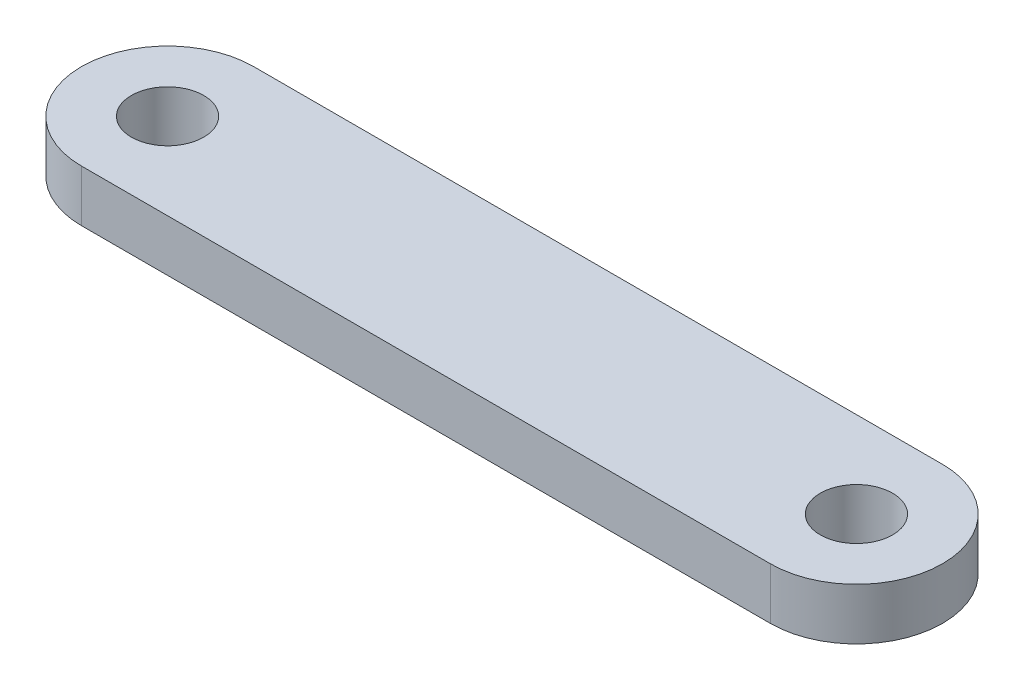
ISO-10303-21;
HEADER;
FILE_DESCRIPTION(('STEP AP214'),'2;1');
FILE_NAME('part.step','',(''),(''),'','','');
FILE_SCHEMA(('AUTOMOTIVE_DESIGN { 1 0 10303 214 1 1 1 1 }'));
ENDSEC;
DATA;
#1=APPLICATION_CONTEXT('core data for automotive mechanical design processes');
#2=APPLICATION_PROTOCOL_DEFINITION('international standard','automotive_design',2000,#1);
#3=PRODUCT_CONTEXT('',#1,'mechanical');
#4=PRODUCT('Part','Part','',(#3));
#5=PRODUCT_RELATED_PRODUCT_CATEGORY('part','',(#4));
#6=PRODUCT_DEFINITION_FORMATION('','',#4);
#7=PRODUCT_DEFINITION_CONTEXT('part definition',#1,'design');
#8=PRODUCT_DEFINITION('design','',#6,#7);
#9=PRODUCT_DEFINITION_SHAPE('','',#8);
#10=(LENGTH_UNIT() NAMED_UNIT(*) SI_UNIT(.MILLI.,.METRE.));
#11=(NAMED_UNIT(*) PLANE_ANGLE_UNIT() SI_UNIT($,.RADIAN.));
#12=(NAMED_UNIT(*) SI_UNIT($,.STERADIAN.) SOLID_ANGLE_UNIT());
#13=UNCERTAINTY_MEASURE_WITH_UNIT(LENGTH_MEASURE(1.E-05),#10,'distance_accuracy_value','');
#14=(GEOMETRIC_REPRESENTATION_CONTEXT(3) GLOBAL_UNCERTAINTY_ASSIGNED_CONTEXT((#13)) GLOBAL_UNIT_ASSIGNED_CONTEXT((#10,
#11,#12)) REPRESENTATION_CONTEXT('',''));
#15=CARTESIAN_POINT('',(0.,0.,0.));
#16=DIRECTION('',(0.,0.,1.));
#17=DIRECTION('',(1.,0.,0.));
#18=AXIS2_PLACEMENT_3D('',#15,#16,#17);
#19=CARTESIAN_POINT('',(-20.,3.,0.));
#20=DIRECTION('',(0.,1.,0.));
#21=DIRECTION('',(0.,0.,1.));
#22=AXIS2_PLACEMENT_3D('',#19,#20,#21);
#23=PLANE('',#22);
#24=CARTESIAN_POINT('',(-20.,3.,0.));
#25=DIRECTION('',(0.,1.,0.));
#26=DIRECTION('',(0.,0.,1.));
#27=AXIS2_PLACEMENT_3D('',#24,#25,#26);
#28=CIRCLE('',#27,5.);
#29=CARTESIAN_POINT('',(-20.,3.,-5.));
#30=VERTEX_POINT('',#29);
#31=CARTESIAN_POINT('',(-20.,3.,5.));
#32=VERTEX_POINT('',#31);
#33=EDGE_CURVE('E83',#30,#32,#28,.T.);
#34=ORIENTED_EDGE('',*,*,#33,.T.);
#35=DIRECTION('',(1.,0.,0.));
#36=VECTOR('',#35,1.);
#37=CARTESIAN_POINT('',(20.,3.,5.));
#38=LINE('',#37,#36);
#39=CARTESIAN_POINT('',(20.,3.,5.));
#40=VERTEX_POINT('',#39);
#41=EDGE_CURVE('E78',#32,#40,#38,.T.);
#42=ORIENTED_EDGE('',*,*,#41,.T.);
#43=CARTESIAN_POINT('',(20.,3.,0.));
#44=DIRECTION('',(0.,1.,0.));
#45=DIRECTION('',(0.,0.,-1.));
#46=AXIS2_PLACEMENT_3D('',#43,#44,#45);
#47=CIRCLE('',#46,5.);
#48=CARTESIAN_POINT('',(20.,3.,-5.));
#49=VERTEX_POINT('',#48);
#50=EDGE_CURVE('E81',#40,#49,#47,.T.);
#51=ORIENTED_EDGE('',*,*,#50,.T.);
#52=DIRECTION('',(-1.,0.,0.));
#53=VECTOR('',#52,1.);
#54=CARTESIAN_POINT('',(20.,3.,-5.));
#55=LINE('',#54,#53);
#56=EDGE_CURVE('E48',#49,#30,#55,.T.);
#57=ORIENTED_EDGE('',*,*,#56,.T.);
#58=EDGE_LOOP('',(#34,#42,#51,#57));
#59=FACE_BOUND('',#58,.T.);
#60=CARTESIAN_POINT('',(-20.,3.,0.));
#61=DIRECTION('',(0.,1.,0.));
#62=DIRECTION('',(0.,0.,1.));
#63=AXIS2_PLACEMENT_3D('',#60,#61,#62);
#64=CIRCLE('',#63,2.1);
#65=CARTESIAN_POINT('',(-20.,3.,2.1));
#66=VERTEX_POINT('',#65);
#67=EDGE_CURVE('E110',#66,#66,#64,.T.);
#68=ORIENTED_EDGE('',*,*,#67,.F.);
#69=EDGE_LOOP('',(#68));
#70=FACE_BOUND('',#69,.T.);
#71=CARTESIAN_POINT('',(20.,3.,0.));
#72=DIRECTION('',(0.,-1.,0.));
#73=DIRECTION('',(0.,0.,1.));
#74=AXIS2_PLACEMENT_3D('',#71,#72,#73);
#75=CIRCLE('',#74,2.1);
#76=CARTESIAN_POINT('',(20.,3.,2.1));
#77=VERTEX_POINT('',#76);
#78=EDGE_CURVE('E116',#77,#77,#75,.T.);
#79=ORIENTED_EDGE('',*,*,#78,.T.);
#80=EDGE_LOOP('',(#79));
#81=FACE_BOUND('',#80,.T.);
#82=ADVANCED_FACE('F31',(#59,#70,#81),#23,.T.);
#83=CARTESIAN_POINT('',(-20.,0.,0.));
#84=DIRECTION('',(0.,1.,0.));
#85=DIRECTION('',(0.,0.,1.));
#86=AXIS2_PLACEMENT_3D('',#83,#84,#85);
#87=PLANE('',#86);
#88=CARTESIAN_POINT('',(-20.,0.,0.));
#89=DIRECTION('',(0.,1.,0.));
#90=DIRECTION('',(0.,0.,1.));
#91=AXIS2_PLACEMENT_3D('',#88,#89,#90);
#92=CIRCLE('',#91,5.);
#93=CARTESIAN_POINT('',(-20.,0.,-5.));
#94=VERTEX_POINT('',#93);
#95=CARTESIAN_POINT('',(-20.,0.,5.));
#96=VERTEX_POINT('',#95);
#97=EDGE_CURVE('E95',#94,#96,#92,.T.);
#98=ORIENTED_EDGE('',*,*,#97,.F.);
#99=DIRECTION('',(-1.,0.,0.));
#100=VECTOR('',#99,1.);
#101=CARTESIAN_POINT('',(20.,0.,-5.));
#102=LINE('',#101,#100);
#103=CARTESIAN_POINT('',(20.,0.,-5.));
#104=VERTEX_POINT('',#103);
#105=EDGE_CURVE('E71',#104,#94,#102,.T.);
#106=ORIENTED_EDGE('',*,*,#105,.F.);
#107=CARTESIAN_POINT('',(20.,0.,0.));
#108=DIRECTION('',(0.,1.,0.));
#109=DIRECTION('',(0.,0.,-1.));
#110=AXIS2_PLACEMENT_3D('',#107,#108,#109);
#111=CIRCLE('',#110,5.);
#112=CARTESIAN_POINT('',(20.,0.,5.));
#113=VERTEX_POINT('',#112);
#114=EDGE_CURVE('E65',#113,#104,#111,.T.);
#115=ORIENTED_EDGE('',*,*,#114,.F.);
#116=DIRECTION('',(1.,0.,0.));
#117=VECTOR('',#116,1.);
#118=CARTESIAN_POINT('',(20.,0.,5.));
#119=LINE('',#118,#117);
#120=EDGE_CURVE('E87',#96,#113,#119,.T.);
#121=ORIENTED_EDGE('',*,*,#120,.F.);
#122=EDGE_LOOP('',(#98,#106,#115,#121));
#123=FACE_BOUND('',#122,.T.);
#124=CARTESIAN_POINT('',(-20.,0.,0.));
#125=DIRECTION('',(0.,1.,0.));
#126=DIRECTION('',(0.,0.,1.));
#127=AXIS2_PLACEMENT_3D('',#124,#125,#126);
#128=CIRCLE('',#127,2.1);
#129=CARTESIAN_POINT('',(-20.,0.,2.1));
#130=VERTEX_POINT('',#129);
#131=EDGE_CURVE('E98',#130,#130,#128,.T.);
#132=ORIENTED_EDGE('',*,*,#131,.T.);
#133=EDGE_LOOP('',(#132));
#134=FACE_BOUND('',#133,.T.);
#135=CARTESIAN_POINT('',(20.,0.,0.));
#136=DIRECTION('',(0.,-1.,0.));
#137=DIRECTION('',(0.,0.,1.));
#138=AXIS2_PLACEMENT_3D('',#135,#136,#137);
#139=CIRCLE('',#138,2.1);
#140=CARTESIAN_POINT('',(20.,0.,2.1));
#141=VERTEX_POINT('',#140);
#142=EDGE_CURVE('E113',#141,#141,#139,.T.);
#143=ORIENTED_EDGE('',*,*,#142,.F.);
#144=EDGE_LOOP('',(#143));
#145=FACE_BOUND('',#144,.T.);
#146=ADVANCED_FACE('F106',(#123,#134,#145),#87,.F.);
#147=CARTESIAN_POINT('',(-20.,3.,0.));
#148=DIRECTION('',(0.,-1.,0.));
#149=DIRECTION('',(0.,0.,-1.));
#150=AXIS2_PLACEMENT_3D('',#147,#148,#149);
#151=CYLINDRICAL_SURFACE('',#150,5.);
#152=ORIENTED_EDGE('',*,*,#97,.T.);
#153=DIRECTION('',(0.,-1.,0.));
#154=VECTOR('',#153,1.);
#155=CARTESIAN_POINT('',(-20.,3.,5.));
#156=LINE('',#155,#154);
#157=EDGE_CURVE('E11',#32,#96,#156,.T.);
#158=ORIENTED_EDGE('',*,*,#157,.F.);
#159=ORIENTED_EDGE('',*,*,#33,.F.);
#160=DIRECTION('',(0.,-1.,0.));
#161=VECTOR('',#160,1.);
#162=CARTESIAN_POINT('',(-20.,3.,-5.));
#163=LINE('',#162,#161);
#164=EDGE_CURVE('E91',#30,#94,#163,.T.);
#165=ORIENTED_EDGE('',*,*,#164,.T.);
#166=EDGE_LOOP('',(#152,#158,#159,#165));
#167=FACE_BOUND('',#166,.T.);
#168=ADVANCED_FACE('F33',(#167),#151,.T.);
#169=CARTESIAN_POINT('',(20.,3.,5.));
#170=DIRECTION('',(0.,0.,-1.));
#171=DIRECTION('',(-1.,0.,0.));
#172=AXIS2_PLACEMENT_3D('',#169,#170,#171);
#173=PLANE('',#172);
#174=ORIENTED_EDGE('',*,*,#120,.T.);
#175=DIRECTION('',(0.,-1.,0.));
#176=VECTOR('',#175,1.);
#177=CARTESIAN_POINT('',(20.,3.,5.));
#178=LINE('',#177,#176);
#179=EDGE_CURVE('E40',#40,#113,#178,.T.);
#180=ORIENTED_EDGE('',*,*,#179,.F.);
#181=ORIENTED_EDGE('',*,*,#41,.F.);
#182=ORIENTED_EDGE('',*,*,#157,.T.);
#183=EDGE_LOOP('',(#174,#180,#181,#182));
#184=FACE_BOUND('',#183,.T.);
#185=ADVANCED_FACE('F86',(#184),#173,.F.);
#186=CARTESIAN_POINT('',(20.,3.,0.));
#187=DIRECTION('',(0.,-1.,0.));
#188=DIRECTION('',(0.,0.,-1.));
#189=AXIS2_PLACEMENT_3D('',#186,#187,#188);
#190=CYLINDRICAL_SURFACE('',#189,5.);
#191=ORIENTED_EDGE('',*,*,#114,.T.);
#192=DIRECTION('',(0.,-1.,0.));
#193=VECTOR('',#192,1.);
#194=CARTESIAN_POINT('',(20.,3.,-5.));
#195=LINE('',#194,#193);
#196=EDGE_CURVE('E88',#49,#104,#195,.T.);
#197=ORIENTED_EDGE('',*,*,#196,.F.);
#198=ORIENTED_EDGE('',*,*,#50,.F.);
#199=ORIENTED_EDGE('',*,*,#179,.T.);
#200=EDGE_LOOP('',(#191,#197,#198,#199));
#201=FACE_BOUND('',#200,.T.);
#202=ADVANCED_FACE('F89',(#201),#190,.T.);
#203=CARTESIAN_POINT('',(20.,3.,-5.));
#204=DIRECTION('',(0.,0.,1.));
#205=DIRECTION('',(1.,0.,0.));
#206=AXIS2_PLACEMENT_3D('',#203,#204,#205);
#207=PLANE('',#206);
#208=ORIENTED_EDGE('',*,*,#105,.T.);
#209=ORIENTED_EDGE('',*,*,#164,.F.);
#210=ORIENTED_EDGE('',*,*,#56,.F.);
#211=ORIENTED_EDGE('',*,*,#196,.T.);
#212=EDGE_LOOP('',(#208,#209,#210,#211));
#213=FACE_BOUND('',#212,.T.);
#214=ADVANCED_FACE('F103',(#213),#207,.F.);
#215=CARTESIAN_POINT('',(-20.,0.,0.));
#216=DIRECTION('',(0.,1.,0.));
#217=DIRECTION('',(0.,0.,1.));
#218=AXIS2_PLACEMENT_3D('',#215,#216,#217);
#219=CYLINDRICAL_SURFACE('',#218,2.1);
#220=ORIENTED_EDGE('',*,*,#131,.F.);
#221=EDGE_LOOP('',(#220));
#222=FACE_BOUND('',#221,.T.);
#223=ORIENTED_EDGE('',*,*,#67,.T.);
#224=EDGE_LOOP('',(#223));
#225=FACE_BOUND('',#224,.T.);
#226=ADVANCED_FACE('F136',(#222,#225),#219,.F.);
#227=CARTESIAN_POINT('',(20.,0.,0.));
#228=DIRECTION('',(0.,1.,0.));
#229=DIRECTION('',(0.,0.,1.));
#230=AXIS2_PLACEMENT_3D('',#227,#228,#229);
#231=CYLINDRICAL_SURFACE('',#230,2.1);
#232=ORIENTED_EDGE('',*,*,#142,.T.);
#233=EDGE_LOOP('',(#232));
#234=FACE_BOUND('',#233,.T.);
#235=ORIENTED_EDGE('',*,*,#78,.F.);
#236=EDGE_LOOP('',(#235));
#237=FACE_BOUND('',#236,.T.);
#238=ADVANCED_FACE('F122',(#234,#237),#231,.F.);
#239=CLOSED_SHELL('',(#82,#146,#168,#185,#202,#214,#226,#238));
#240=MANIFOLD_SOLID_BREP('B2',#239);
#241=ADVANCED_BREP_SHAPE_REPRESENTATION('',(#18,#240),#14);
#242=SHAPE_DEFINITION_REPRESENTATION(#9,#241);
ENDSEC;
END-ISO-10303-21;
